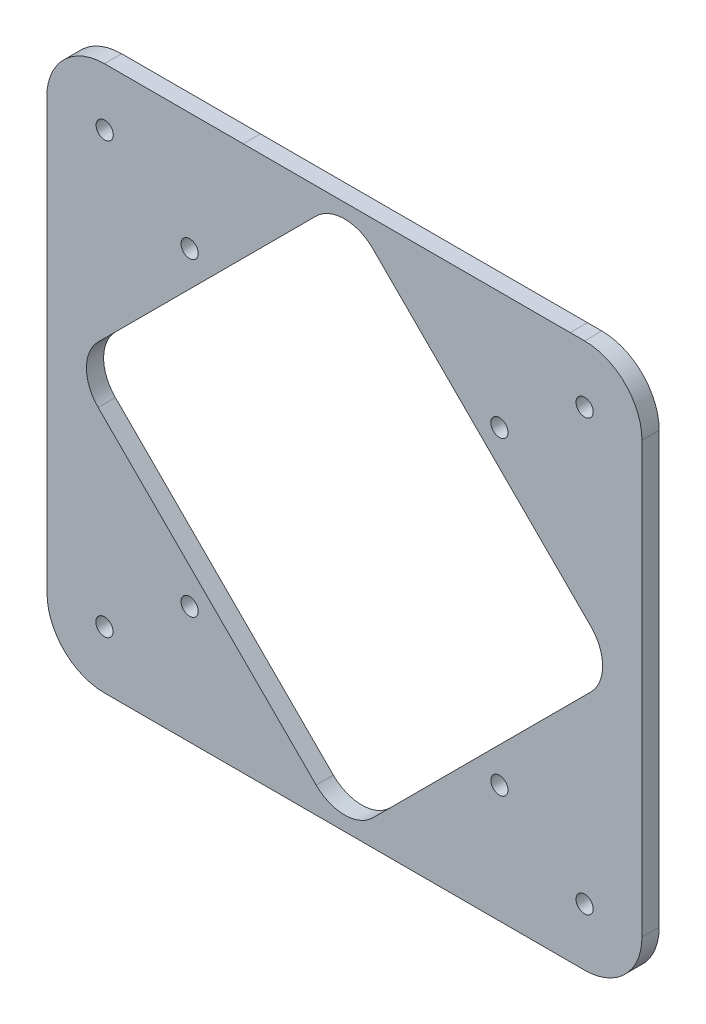
ISO-10303-21;
HEADER;
FILE_DESCRIPTION(('STEP AP214'),'2;1');
FILE_NAME('part.step','',(''),(''),'','','');
FILE_SCHEMA(('AUTOMOTIVE_DESIGN { 1 0 10303 214 1 1 1 1 }'));
ENDSEC;
DATA;
#1=APPLICATION_CONTEXT('core data for automotive mechanical design processes');
#2=APPLICATION_PROTOCOL_DEFINITION('international standard','automotive_design',2000,#1);
#3=PRODUCT_CONTEXT('',#1,'mechanical');
#4=PRODUCT('Part','Part','',(#3));
#5=PRODUCT_RELATED_PRODUCT_CATEGORY('part','',(#4));
#6=PRODUCT_DEFINITION_FORMATION('','',#4);
#7=PRODUCT_DEFINITION_CONTEXT('part definition',#1,'design');
#8=PRODUCT_DEFINITION('design','',#6,#7);
#9=PRODUCT_DEFINITION_SHAPE('','',#8);
#10=(LENGTH_UNIT() NAMED_UNIT(*) SI_UNIT(.MILLI.,.METRE.));
#11=(NAMED_UNIT(*) PLANE_ANGLE_UNIT() SI_UNIT($,.RADIAN.));
#12=(NAMED_UNIT(*) SI_UNIT($,.STERADIAN.) SOLID_ANGLE_UNIT());
#13=UNCERTAINTY_MEASURE_WITH_UNIT(LENGTH_MEASURE(1.E-05),#10,'distance_accuracy_value','');
#14=(GEOMETRIC_REPRESENTATION_CONTEXT(3) GLOBAL_UNCERTAINTY_ASSIGNED_CONTEXT((#13)) GLOBAL_UNIT_ASSIGNED_CONTEXT((#10,
#11,#12)) REPRESENTATION_CONTEXT('',''));
#15=CARTESIAN_POINT('',(0.,0.,0.));
#16=DIRECTION('',(0.,0.,1.));
#17=DIRECTION('',(1.,0.,0.));
#18=AXIS2_PLACEMENT_3D('',#15,#16,#17);
#19=CARTESIAN_POINT('',(2216.74040626952,1503.10014922375,3.));
#20=DIRECTION('',(0.,0.,1.));
#21=DIRECTION('',(1.,0.,0.));
#22=AXIS2_PLACEMENT_3D('',#19,#20,#21);
#23=PLANE('',#22);
#24=CARTESIAN_POINT('',(2216.78279744771,1578.10008841039,3.));
#25=DIRECTION('',(0.,0.,1.));
#26=DIRECTION('',(1.,0.,0.));
#27=AXIS2_PLACEMENT_3D('',#24,#25,#26);
#28=CIRCLE('',#27,1.50000000000011);
#29=CARTESIAN_POINT('',(2218.28279744771,1578.10008841039,3.));
#30=VERTEX_POINT('',#29);
#31=EDGE_CURVE('E246',#30,#30,#28,.T.);
#32=ORIENTED_EDGE('',*,*,#31,.F.);
#33=EDGE_LOOP('',(#32));
#34=FACE_BOUND('',#33,.T.);
#35=CARTESIAN_POINT('',(2300.44026999763,1578.10008841039,3.));
#36=DIRECTION('',(0.,0.,1.));
#37=DIRECTION('',(1.,0.,0.));
#38=AXIS2_PLACEMENT_3D('',#35,#36,#37);
#39=CIRCLE('',#38,1.50000000000011);
#40=CARTESIAN_POINT('',(2301.94026999763,1578.10008841039,3.));
#41=VERTEX_POINT('',#40);
#42=EDGE_CURVE('E258',#41,#41,#39,.T.);
#43=ORIENTED_EDGE('',*,*,#42,.F.);
#44=EDGE_LOOP('',(#43));
#45=FACE_BOUND('',#44,.T.);
#46=CARTESIAN_POINT('',(2231.5903515115,1513.60007121959,3.));
#47=DIRECTION('',(0.,0.,1.));
#48=DIRECTION('',(1.,0.,0.));
#49=AXIS2_PLACEMENT_3D('',#46,#47,#48);
#50=CIRCLE('',#49,1.50000000000011);
#51=CARTESIAN_POINT('',(2233.0903515115,1513.60007121959,3.));
#52=VERTEX_POINT('',#51);
#53=EDGE_CURVE('E270',#52,#52,#50,.T.);
#54=ORIENTED_EDGE('',*,*,#53,.F.);
#55=EDGE_LOOP('',(#54));
#56=FACE_BOUND('',#55,.T.);
#57=CARTESIAN_POINT('',(2216.74034545616,1503.10008841039,3.));
#58=DIRECTION('',(0.,0.,1.));
#59=DIRECTION('',(1.,0.,0.));
#60=AXIS2_PLACEMENT_3D('',#57,#58,#59);
#61=CIRCLE('',#60,1.50000000000011);
#62=CARTESIAN_POINT('',(2218.24034545616,1503.10008841039,3.));
#63=VERTEX_POINT('',#62);
#64=EDGE_CURVE('E282',#63,#63,#61,.T.);
#65=ORIENTED_EDGE('',*,*,#64,.F.);
#66=EDGE_LOOP('',(#65));
#67=FACE_BOUND('',#66,.T.);
#68=CARTESIAN_POINT('',(2216.74040626952,1503.10014922375,3.));
#69=DIRECTION('',(0.,0.,1.));
#70=DIRECTION('',(1.,0.,0.));
#71=AXIS2_PLACEMENT_3D('',#68,#69,#70);
#72=CIRCLE('',#71,10.0000608135399);
#73=CARTESIAN_POINT('',(2206.74034545616,1503.10008841039,3.));
#74=VERTEX_POINT('',#73);
#75=CARTESIAN_POINT('',(2216.74034545616,1493.10008841039,3.));
#76=VERTEX_POINT('',#75);
#77=EDGE_CURVE('E288',#74,#76,#72,.T.);
#78=ORIENTED_EDGE('',*,*,#77,.T.);
#79=DIRECTION('',(1.,0.,0.));
#80=VECTOR('',#79,1.);
#81=CARTESIAN_POINT('',(2300.44034545616,1493.10008841039,3.));
#82=LINE('',#81,#80);
#83=CARTESIAN_POINT('',(2300.44034545616,1493.10008841039,3.));
#84=VERTEX_POINT('',#83);
#85=EDGE_CURVE('E291',#76,#84,#82,.T.);
#86=ORIENTED_EDGE('',*,*,#85,.T.);
#87=CARTESIAN_POINT('',(2300.44026999763,1503.10006386867,3.));
#88=DIRECTION('',(0.,0.,1.));
#89=DIRECTION('',(1.,0.,0.));
#90=AXIS2_PLACEMENT_3D('',#87,#88,#89);
#91=CIRCLE('',#90,9.99997545856066);
#92=CARTESIAN_POINT('',(2310.44024545616,1503.10008841033,3.));
#93=VERTEX_POINT('',#92);
#94=EDGE_CURVE('E294',#84,#93,#91,.T.);
#95=ORIENTED_EDGE('',*,*,#94,.T.);
#96=DIRECTION('',(0.,1.,0.));
#97=VECTOR('',#96,1.);
#98=CARTESIAN_POINT('',(2310.44024545616,1572.46853862692,3.));
#99=LINE('',#98,#97);
#100=CARTESIAN_POINT('',(2310.44024545616,1578.10008841028,3.));
#101=VERTEX_POINT('',#100);
#102=EDGE_CURVE('E296',#93,#101,#99,.T.);
#103=ORIENTED_EDGE('',*,*,#102,.T.);
#104=CARTESIAN_POINT('',(2300.44035535289,1578.10019830652,3.));
#105=DIRECTION('',(0.,0.,1.));
#106=DIRECTION('',(1.,0.,0.));
#107=AXIS2_PLACEMENT_3D('',#104,#105,#106);
#108=CIRCLE('',#107,9.9998901038741);
#109=CARTESIAN_POINT('',(2300.44034545616,1588.10008841039,3.));
#110=VERTEX_POINT('',#109);
#111=EDGE_CURVE('E298',#101,#110,#108,.T.);
#112=ORIENTED_EDGE('',*,*,#111,.T.);
#113=DIRECTION('',(-0.999999995251973,-9.74476991777508E-05,0.));
#114=VECTOR('',#113,1.);
#115=CARTESIAN_POINT('',(2297.94063007068,1588.09984481888,3.));
#116=LINE('',#115,#114);
#117=CARTESIAN_POINT('',(2297.94063007068,1588.09984481888,3.));
#118=VERTEX_POINT('',#117);
#119=EDGE_CURVE('E300',#110,#118,#116,.T.);
#120=ORIENTED_EDGE('',*,*,#119,.T.);
#121=DIRECTION('',(-0.999999999986851,5.12821083089522E-06,0.));
#122=VECTOR('',#121,1.);
#123=CARTESIAN_POINT('',(2297.94063007068,1588.09984481888,3.));
#124=LINE('',#123,#122);
#125=CARTESIAN_POINT('',(2240.94063007143,1588.1001371269,3.));
#126=VERTEX_POINT('',#125);
#127=EDGE_CURVE('E302',#118,#126,#124,.T.);
#128=ORIENTED_EDGE('',*,*,#127,.T.);
#129=DIRECTION('',(-0.999999999997974,-2.01305499982283E-06,0.));
#130=VECTOR('',#129,1.);
#131=CARTESIAN_POINT('',(2216.74034545616,1588.10008841039,3.));
#132=LINE('',#131,#130);
#133=CARTESIAN_POINT('',(2216.74034545616,1588.10008841039,3.));
#134=VERTEX_POINT('',#133);
#135=EDGE_CURVE('E304',#126,#134,#132,.T.);
#136=ORIENTED_EDGE('',*,*,#135,.T.);
#137=CARTESIAN_POINT('',(2216.78285826107,1577.99729640494,3.));
#138=DIRECTION('',(0.,0.,1.));
#139=DIRECTION('',(1.,0.,0.));
#140=AXIS2_PLACEMENT_3D('',#137,#138,#139);
#141=CIRCLE('',#140,10.1028814525364);
#142=CARTESIAN_POINT('',(2206.74034545616,1579.1000884104,3.));
#143=VERTEX_POINT('',#142);
#144=EDGE_CURVE('E306',#134,#143,#141,.T.);
#145=ORIENTED_EDGE('',*,*,#144,.T.);
#146=CARTESIAN_POINT('',(2216.78289739703,1578.09908414489,3.));
#147=DIRECTION('',(0.,0.,1.));
#148=DIRECTION('',(1.,0.,0.));
#149=AXIS2_PLACEMENT_3D('',#146,#147,#148);
#150=CIRCLE('',#149,10.0923168313646);
#151=CARTESIAN_POINT('',(2206.74014545616,1577.10008840977,3.));
#152=VERTEX_POINT('',#151);
#153=EDGE_CURVE('E308',#143,#152,#150,.T.);
#154=ORIENTED_EDGE('',*,*,#153,.T.);
#155=DIRECTION('',(0.,-1.,0.));
#156=VECTOR('',#155,1.);
#157=CARTESIAN_POINT('',(2206.74014545616,1564.74160273374,3.));
#158=LINE('',#157,#156);
#159=CARTESIAN_POINT('',(2206.74014545616,1564.74160273374,3.));
#160=VERTEX_POINT('',#159);
#161=EDGE_CURVE('E310',#152,#160,#158,.T.);
#162=ORIENTED_EDGE('',*,*,#161,.T.);
#163=DIRECTION('',(3.24456661104093E-06,-0.999999999994737,0.));
#164=VECTOR('',#163,1.);
#165=CARTESIAN_POINT('',(2206.74014545616,1564.74160273374,3.));
#166=LINE('',#165,#164);
#167=EDGE_CURVE('E312',#160,#74,#166,.T.);
#168=ORIENTED_EDGE('',*,*,#167,.T.);
#169=EDGE_LOOP('',(#78,#86,#95,#103,#112,#120,#128,#136,#145,#154,#162,#168));
#170=FACE_BOUND('',#169,.T.);
#171=CARTESIAN_POINT('',(2300.44026999763,1503.10006386867,3.));
#172=DIRECTION('',(0.,0.,1.));
#173=DIRECTION('',(1.,0.,0.));
#174=AXIS2_PLACEMENT_3D('',#171,#172,#173);
#175=CIRCLE('',#174,1.50000000000011);
#176=CARTESIAN_POINT('',(2301.94026999763,1503.10006386867,3.));
#177=VERTEX_POINT('',#176);
#178=EDGE_CURVE('E276',#177,#177,#175,.T.);
#179=ORIENTED_EDGE('',*,*,#178,.F.);
#180=EDGE_LOOP('',(#179));
#181=FACE_BOUND('',#180,.T.);
#182=CARTESIAN_POINT('',(2285.59035378313,1513.60007121959,3.));
#183=DIRECTION('',(0.,0.,1.));
#184=DIRECTION('',(1.,0.,0.));
#185=AXIS2_PLACEMENT_3D('',#182,#183,#184);
#186=CIRCLE('',#185,1.50000000000011);
#187=CARTESIAN_POINT('',(2287.09035378313,1513.60007121959,3.));
#188=VERTEX_POINT('',#187);
#189=EDGE_CURVE('E264',#188,#188,#186,.T.);
#190=ORIENTED_EDGE('',*,*,#189,.F.);
#191=EDGE_LOOP('',(#190));
#192=FACE_BOUND('',#191,.T.);
#193=CARTESIAN_POINT('',(2285.59035378313,1567.60011895622,3.));
#194=DIRECTION('',(0.,0.,1.));
#195=DIRECTION('',(1.,0.,0.));
#196=AXIS2_PLACEMENT_3D('',#193,#194,#195);
#197=CIRCLE('',#196,1.50000000000011);
#198=CARTESIAN_POINT('',(2287.09035378313,1567.60011895622,3.));
#199=VERTEX_POINT('',#198);
#200=EDGE_CURVE('E252',#199,#199,#197,.T.);
#201=ORIENTED_EDGE('',*,*,#200,.F.);
#202=EDGE_LOOP('',(#201));
#203=FACE_BOUND('',#202,.T.);
#204=CARTESIAN_POINT('',(2231.5903515115,1567.60011895622,3.));
#205=DIRECTION('',(0.,0.,1.));
#206=DIRECTION('',(1.,0.,0.));
#207=AXIS2_PLACEMENT_3D('',#204,#205,#206);
#208=CIRCLE('',#207,1.50000000000011);
#209=CARTESIAN_POINT('',(2233.0903515115,1567.60011895622,3.));
#210=VERTEX_POINT('',#209);
#211=EDGE_CURVE('E240',#210,#210,#208,.T.);
#212=ORIENTED_EDGE('',*,*,#211,.F.);
#213=EDGE_LOOP('',(#212));
#214=FACE_BOUND('',#213,.T.);
#215=DIRECTION('',(-0.707106781186554,0.707106781186541,0.));
#216=VECTOR('',#215,1.);
#217=CARTESIAN_POINT('',(2263.54009292447,1583.54117663951,3.));
#218=LINE('',#217,#216);
#219=CARTESIAN_POINT('',(2301.53147095311,1545.54979861087,3.));
#220=VERTEX_POINT('',#219);
#221=CARTESIAN_POINT('',(2263.54009292447,1583.54117663951,3.));
#222=VERTEX_POINT('',#221);
#223=EDGE_CURVE('E183',#220,#222,#218,.T.);
#224=ORIENTED_EDGE('',*,*,#223,.F.);
#225=CARTESIAN_POINT('',(2296.58172348481,1540.60005114256,3.));
#226=DIRECTION('',(0.,0.,1.));
#227=DIRECTION('',(1.,0.,0.));
#228=AXIS2_PLACEMENT_3D('',#225,#226,#227);
#229=CIRCLE('',#228,7.00000000000002);
#230=CARTESIAN_POINT('',(2301.53147095311,1535.65030367425,3.));
#231=VERTEX_POINT('',#230);
#232=EDGE_CURVE('E175',#231,#220,#229,.T.);
#233=ORIENTED_EDGE('',*,*,#232,.F.);
#234=DIRECTION('',(0.707106781186543,0.707106781186552,0.));
#235=VECTOR('',#234,1.);
#236=CARTESIAN_POINT('',(2301.53147095311,1535.65030367425,3.));
#237=LINE('',#236,#235);
#238=CARTESIAN_POINT('',(2263.54009292447,1497.65892564561,3.));
#239=VERTEX_POINT('',#238);
#240=EDGE_CURVE('E208',#239,#231,#237,.T.);
#241=ORIENTED_EDGE('',*,*,#240,.F.);
#242=CARTESIAN_POINT('',(2258.59034545616,1502.60867311391,3.));
#243=DIRECTION('',(0.,0.,1.));
#244=DIRECTION('',(1.,0.,0.));
#245=AXIS2_PLACEMENT_3D('',#242,#243,#244);
#246=CIRCLE('',#245,6.99999999999962);
#247=CARTESIAN_POINT('',(2253.64059798786,1497.65892564561,3.));
#248=VERTEX_POINT('',#247);
#249=EDGE_CURVE('E206',#248,#239,#246,.T.);
#250=ORIENTED_EDGE('',*,*,#249,.F.);
#251=DIRECTION('',(0.707106781186543,-0.707106781186552,0.));
#252=VECTOR('',#251,1.);
#253=CARTESIAN_POINT('',(2215.64921995921,1535.65030367425,3.));
#254=LINE('',#253,#252);
#255=CARTESIAN_POINT('',(2215.64921995921,1535.65030367425,3.));
#256=VERTEX_POINT('',#255);
#257=EDGE_CURVE('E204',#256,#248,#254,.T.);
#258=ORIENTED_EDGE('',*,*,#257,.F.);
#259=CARTESIAN_POINT('',(2220.59896742751,1540.60005114256,3.));
#260=DIRECTION('',(0.,0.,1.));
#261=DIRECTION('',(1.,0.,0.));
#262=AXIS2_PLACEMENT_3D('',#259,#260,#261);
#263=CIRCLE('',#262,7.00000000000002);
#264=CARTESIAN_POINT('',(2215.64921995921,1545.54979861087,3.));
#265=VERTEX_POINT('',#264);
#266=EDGE_CURVE('E202',#265,#256,#263,.T.);
#267=ORIENTED_EDGE('',*,*,#266,.F.);
#268=DIRECTION('',(-0.70710678118655,-0.707106781186545,0.));
#269=VECTOR('',#268,1.);
#270=CARTESIAN_POINT('',(2215.64921995921,1545.54979861087,3.));
#271=LINE('',#270,#269);
#272=CARTESIAN_POINT('',(2253.64059798786,1583.54117663952,3.));
#273=VERTEX_POINT('',#272);
#274=EDGE_CURVE('E198',#273,#265,#271,.T.);
#275=ORIENTED_EDGE('',*,*,#274,.F.);
#276=CARTESIAN_POINT('',(2258.59034545616,1578.59142917121,3.));
#277=DIRECTION('',(0.,0.,1.));
#278=DIRECTION('',(1.,0.,0.));
#279=AXIS2_PLACEMENT_3D('',#276,#277,#278);
#280=CIRCLE('',#279,6.99999999999962);
#281=EDGE_CURVE('E196',#222,#273,#280,.T.);
#282=ORIENTED_EDGE('',*,*,#281,.F.);
#283=EDGE_LOOP('',(#224,#233,#241,#250,#258,#267,#275,#282));
#284=FACE_BOUND('',#283,.T.);
#285=ADVANCED_FACE('F38',(#34,#45,#56,#67,#170,#181,#192,#203,#214,#284),#23,.T.);
#286=CARTESIAN_POINT('',(2216.74040626952,1503.10014922375,0.));
#287=DIRECTION('',(0.,0.,1.));
#288=DIRECTION('',(1.,0.,0.));
#289=AXIS2_PLACEMENT_3D('',#286,#287,#288);
#290=PLANE('',#289);
#291=CARTESIAN_POINT('',(2231.5903515115,1567.60011895622,0.));
#292=DIRECTION('',(0.,0.,1.));
#293=DIRECTION('',(1.,0.,0.));
#294=AXIS2_PLACEMENT_3D('',#291,#292,#293);
#295=CIRCLE('',#294,1.50000000000011);
#296=CARTESIAN_POINT('',(2233.0903515115,1567.60011895622,0.));
#297=VERTEX_POINT('',#296);
#298=EDGE_CURVE('E191',#297,#297,#295,.T.);
#299=ORIENTED_EDGE('',*,*,#298,.T.);
#300=EDGE_LOOP('',(#299));
#301=FACE_BOUND('',#300,.T.);
#302=CARTESIAN_POINT('',(2216.78279744771,1578.10008841039,0.));
#303=DIRECTION('',(0.,0.,1.));
#304=DIRECTION('',(1.,0.,0.));
#305=AXIS2_PLACEMENT_3D('',#302,#303,#304);
#306=CIRCLE('',#305,1.50000000000011);
#307=CARTESIAN_POINT('',(2218.28279744771,1578.10008841039,0.));
#308=VERTEX_POINT('',#307);
#309=EDGE_CURVE('E243',#308,#308,#306,.T.);
#310=ORIENTED_EDGE('',*,*,#309,.T.);
#311=EDGE_LOOP('',(#310));
#312=FACE_BOUND('',#311,.T.);
#313=CARTESIAN_POINT('',(2285.59035378313,1567.60011895622,0.));
#314=DIRECTION('',(0.,0.,1.));
#315=DIRECTION('',(1.,0.,0.));
#316=AXIS2_PLACEMENT_3D('',#313,#314,#315);
#317=CIRCLE('',#316,1.50000000000011);
#318=CARTESIAN_POINT('',(2287.09035378313,1567.60011895622,0.));
#319=VERTEX_POINT('',#318);
#320=EDGE_CURVE('E249',#319,#319,#317,.T.);
#321=ORIENTED_EDGE('',*,*,#320,.T.);
#322=EDGE_LOOP('',(#321));
#323=FACE_BOUND('',#322,.T.);
#324=CARTESIAN_POINT('',(2300.44026999763,1578.10008841039,0.));
#325=DIRECTION('',(0.,0.,1.));
#326=DIRECTION('',(1.,0.,0.));
#327=AXIS2_PLACEMENT_3D('',#324,#325,#326);
#328=CIRCLE('',#327,1.50000000000011);
#329=CARTESIAN_POINT('',(2301.94026999763,1578.10008841039,0.));
#330=VERTEX_POINT('',#329);
#331=EDGE_CURVE('E255',#330,#330,#328,.T.);
#332=ORIENTED_EDGE('',*,*,#331,.T.);
#333=EDGE_LOOP('',(#332));
#334=FACE_BOUND('',#333,.T.);
#335=CARTESIAN_POINT('',(2285.59035378313,1513.60007121959,0.));
#336=DIRECTION('',(0.,0.,1.));
#337=DIRECTION('',(1.,0.,0.));
#338=AXIS2_PLACEMENT_3D('',#335,#336,#337);
#339=CIRCLE('',#338,1.50000000000011);
#340=CARTESIAN_POINT('',(2287.09035378313,1513.60007121959,0.));
#341=VERTEX_POINT('',#340);
#342=EDGE_CURVE('E261',#341,#341,#339,.T.);
#343=ORIENTED_EDGE('',*,*,#342,.T.);
#344=EDGE_LOOP('',(#343));
#345=FACE_BOUND('',#344,.T.);
#346=CARTESIAN_POINT('',(2231.5903515115,1513.60007121959,0.));
#347=DIRECTION('',(0.,0.,1.));
#348=DIRECTION('',(1.,0.,0.));
#349=AXIS2_PLACEMENT_3D('',#346,#347,#348);
#350=CIRCLE('',#349,1.50000000000011);
#351=CARTESIAN_POINT('',(2233.0903515115,1513.60007121959,0.));
#352=VERTEX_POINT('',#351);
#353=EDGE_CURVE('E267',#352,#352,#350,.T.);
#354=ORIENTED_EDGE('',*,*,#353,.T.);
#355=EDGE_LOOP('',(#354));
#356=FACE_BOUND('',#355,.T.);
#357=CARTESIAN_POINT('',(2300.44026999763,1503.10006386867,0.));
#358=DIRECTION('',(0.,0.,1.));
#359=DIRECTION('',(1.,0.,0.));
#360=AXIS2_PLACEMENT_3D('',#357,#358,#359);
#361=CIRCLE('',#360,1.50000000000011);
#362=CARTESIAN_POINT('',(2301.94026999763,1503.10006386867,0.));
#363=VERTEX_POINT('',#362);
#364=EDGE_CURVE('E273',#363,#363,#361,.T.);
#365=ORIENTED_EDGE('',*,*,#364,.T.);
#366=EDGE_LOOP('',(#365));
#367=FACE_BOUND('',#366,.T.);
#368=CARTESIAN_POINT('',(2216.74034545616,1503.10008841039,0.));
#369=DIRECTION('',(0.,0.,1.));
#370=DIRECTION('',(1.,0.,0.));
#371=AXIS2_PLACEMENT_3D('',#368,#369,#370);
#372=CIRCLE('',#371,1.50000000000011);
#373=CARTESIAN_POINT('',(2218.24034545616,1503.10008841039,0.));
#374=VERTEX_POINT('',#373);
#375=EDGE_CURVE('E279',#374,#374,#372,.T.);
#376=ORIENTED_EDGE('',*,*,#375,.T.);
#377=EDGE_LOOP('',(#376));
#378=FACE_BOUND('',#377,.T.);
#379=CARTESIAN_POINT('',(2216.74040626952,1503.10014922375,0.));
#380=DIRECTION('',(0.,0.,1.));
#381=DIRECTION('',(1.,0.,0.));
#382=AXIS2_PLACEMENT_3D('',#379,#380,#381);
#383=CIRCLE('',#382,10.0000608135399);
#384=CARTESIAN_POINT('',(2206.74034545616,1503.10008841039,0.));
#385=VERTEX_POINT('',#384);
#386=CARTESIAN_POINT('',(2216.74034545616,1493.10008841039,0.));
#387=VERTEX_POINT('',#386);
#388=EDGE_CURVE('E285',#385,#387,#383,.T.);
#389=ORIENTED_EDGE('',*,*,#388,.F.);
#390=DIRECTION('',(3.24456661104093E-06,-0.999999999994737,0.));
#391=VECTOR('',#390,1.);
#392=CARTESIAN_POINT('',(2206.74014545616,1564.74160273374,0.));
#393=LINE('',#392,#391);
#394=CARTESIAN_POINT('',(2206.74014545616,1564.74160273374,0.));
#395=VERTEX_POINT('',#394);
#396=EDGE_CURVE('E292',#395,#385,#393,.T.);
#397=ORIENTED_EDGE('',*,*,#396,.F.);
#398=DIRECTION('',(0.,-1.,0.));
#399=VECTOR('',#398,1.);
#400=CARTESIAN_POINT('',(2206.74014545616,1564.74160273374,0.));
#401=LINE('',#400,#399);
#402=CARTESIAN_POINT('',(2206.74014545616,1577.10008840977,0.));
#403=VERTEX_POINT('',#402);
#404=EDGE_CURVE('E337',#403,#395,#401,.T.);
#405=ORIENTED_EDGE('',*,*,#404,.F.);
#406=CARTESIAN_POINT('',(2216.78289739703,1578.09908414489,0.));
#407=DIRECTION('',(0.,0.,1.));
#408=DIRECTION('',(1.,0.,0.));
#409=AXIS2_PLACEMENT_3D('',#406,#407,#408);
#410=CIRCLE('',#409,10.0923168313646);
#411=CARTESIAN_POINT('',(2206.74034545616,1579.1000884104,0.));
#412=VERTEX_POINT('',#411);
#413=EDGE_CURVE('E335',#412,#403,#410,.T.);
#414=ORIENTED_EDGE('',*,*,#413,.F.);
#415=CARTESIAN_POINT('',(2216.78285826107,1577.99729640494,0.));
#416=DIRECTION('',(0.,0.,1.));
#417=DIRECTION('',(1.,0.,0.));
#418=AXIS2_PLACEMENT_3D('',#415,#416,#417);
#419=CIRCLE('',#418,10.1028814525364);
#420=CARTESIAN_POINT('',(2216.74034545616,1588.10008841039,0.));
#421=VERTEX_POINT('',#420);
#422=EDGE_CURVE('E333',#421,#412,#419,.T.);
#423=ORIENTED_EDGE('',*,*,#422,.F.);
#424=DIRECTION('',(-0.999999999997974,-2.01305499982283E-06,0.));
#425=VECTOR('',#424,1.);
#426=CARTESIAN_POINT('',(2216.74034545616,1588.10008841039,0.));
#427=LINE('',#426,#425);
#428=CARTESIAN_POINT('',(2240.94063007143,1588.1001371269,0.));
#429=VERTEX_POINT('',#428);
#430=EDGE_CURVE('E331',#429,#421,#427,.T.);
#431=ORIENTED_EDGE('',*,*,#430,.F.);
#432=DIRECTION('',(-0.999999999986851,5.12821083376025E-06,0.));
#433=VECTOR('',#432,1.);
#434=CARTESIAN_POINT('',(2265.9406300711,1588.10000892163,0.));
#435=LINE('',#434,#433);
#436=CARTESIAN_POINT('',(2297.94063007068,1588.09984481888,0.));
#437=VERTEX_POINT('',#436);
#438=EDGE_CURVE('E329',#437,#429,#435,.T.);
#439=ORIENTED_EDGE('',*,*,#438,.F.);
#440=DIRECTION('',(-0.999999995251973,-9.74476991777508E-05,0.));
#441=VECTOR('',#440,1.);
#442=CARTESIAN_POINT('',(2297.94063007068,1588.09984481888,0.));
#443=LINE('',#442,#441);
#444=CARTESIAN_POINT('',(2300.44034545616,1588.10008841039,0.));
#445=VERTEX_POINT('',#444);
#446=EDGE_CURVE('E326',#445,#437,#443,.T.);
#447=ORIENTED_EDGE('',*,*,#446,.F.);
#448=CARTESIAN_POINT('',(2300.44035535289,1578.10019830652,0.));
#449=DIRECTION('',(0.,0.,1.));
#450=DIRECTION('',(1.,0.,0.));
#451=AXIS2_PLACEMENT_3D('',#448,#449,#450);
#452=CIRCLE('',#451,9.9998901038741);
#453=CARTESIAN_POINT('',(2310.44024545616,1578.10008841028,0.));
#454=VERTEX_POINT('',#453);
#455=EDGE_CURVE('E324',#454,#445,#452,.T.);
#456=ORIENTED_EDGE('',*,*,#455,.F.);
#457=DIRECTION('',(0.,1.,0.));
#458=VECTOR('',#457,1.);
#459=CARTESIAN_POINT('',(2310.44024545616,1572.46853862692,0.));
#460=LINE('',#459,#458);
#461=CARTESIAN_POINT('',(2310.44024545616,1503.10008841033,0.));
#462=VERTEX_POINT('',#461);
#463=EDGE_CURVE('E322',#462,#454,#460,.T.);
#464=ORIENTED_EDGE('',*,*,#463,.F.);
#465=CARTESIAN_POINT('',(2300.44026999763,1503.10006386867,0.));
#466=DIRECTION('',(0.,0.,1.));
#467=DIRECTION('',(1.,0.,0.));
#468=AXIS2_PLACEMENT_3D('',#465,#466,#467);
#469=CIRCLE('',#468,9.99997545856066);
#470=CARTESIAN_POINT('',(2300.44034545616,1493.10008841039,0.));
#471=VERTEX_POINT('',#470);
#472=EDGE_CURVE('E319',#471,#462,#469,.T.);
#473=ORIENTED_EDGE('',*,*,#472,.F.);
#474=DIRECTION('',(1.,0.,0.));
#475=VECTOR('',#474,1.);
#476=CARTESIAN_POINT('',(2300.44034545616,1493.10008841039,0.));
#477=LINE('',#476,#475);
#478=EDGE_CURVE('E317',#387,#471,#477,.T.);
#479=ORIENTED_EDGE('',*,*,#478,.F.);
#480=EDGE_LOOP('',(#389,#397,#405,#414,#423,#431,#439,#447,#456,#464,#473,#479));
#481=FACE_BOUND('',#480,.T.);
#482=CARTESIAN_POINT('',(2296.58172348481,1540.60005114256,0.));
#483=DIRECTION('',(0.,0.,1.));
#484=DIRECTION('',(1.,0.,0.));
#485=AXIS2_PLACEMENT_3D('',#482,#483,#484);
#486=CIRCLE('',#485,7.00000000000002);
#487=CARTESIAN_POINT('',(2301.53147095311,1535.65030367425,0.));
#488=VERTEX_POINT('',#487);
#489=CARTESIAN_POINT('',(2301.53147095311,1545.54979861087,0.));
#490=VERTEX_POINT('',#489);
#491=EDGE_CURVE('E61',#488,#490,#486,.T.);
#492=ORIENTED_EDGE('',*,*,#491,.T.);
#493=DIRECTION('',(-0.707106781186554,0.707106781186541,0.));
#494=VECTOR('',#493,1.);
#495=CARTESIAN_POINT('',(2263.54009292447,1583.54117663951,0.));
#496=LINE('',#495,#494);
#497=CARTESIAN_POINT('',(2263.54009292447,1583.54117663951,0.));
#498=VERTEX_POINT('',#497);
#499=EDGE_CURVE('E190',#490,#498,#496,.T.);
#500=ORIENTED_EDGE('',*,*,#499,.T.);
#501=CARTESIAN_POINT('',(2258.59034545616,1578.59142917121,0.));
#502=DIRECTION('',(0.,0.,1.));
#503=DIRECTION('',(1.,0.,0.));
#504=AXIS2_PLACEMENT_3D('',#501,#502,#503);
#505=CIRCLE('',#504,6.99999999999962);
#506=CARTESIAN_POINT('',(2253.64059798786,1583.54117663952,0.));
#507=VERTEX_POINT('',#506);
#508=EDGE_CURVE('E212',#498,#507,#505,.T.);
#509=ORIENTED_EDGE('',*,*,#508,.T.);
#510=DIRECTION('',(-0.70710678118655,-0.707106781186545,0.));
#511=VECTOR('',#510,1.);
#512=CARTESIAN_POINT('',(2215.64921995921,1545.54979861087,0.));
#513=LINE('',#512,#511);
#514=CARTESIAN_POINT('',(2215.64921995921,1545.54979861087,0.));
#515=VERTEX_POINT('',#514);
#516=EDGE_CURVE('E215',#507,#515,#513,.T.);
#517=ORIENTED_EDGE('',*,*,#516,.T.);
#518=CARTESIAN_POINT('',(2220.59896742751,1540.60005114256,0.));
#519=DIRECTION('',(0.,0.,1.));
#520=DIRECTION('',(1.,0.,0.));
#521=AXIS2_PLACEMENT_3D('',#518,#519,#520);
#522=CIRCLE('',#521,7.00000000000002);
#523=CARTESIAN_POINT('',(2215.64921995921,1535.65030367425,0.));
#524=VERTEX_POINT('',#523);
#525=EDGE_CURVE('E218',#515,#524,#522,.T.);
#526=ORIENTED_EDGE('',*,*,#525,.T.);
#527=DIRECTION('',(0.707106781186543,-0.707106781186552,0.));
#528=VECTOR('',#527,1.);
#529=CARTESIAN_POINT('',(2215.64921995921,1535.65030367425,0.));
#530=LINE('',#529,#528);
#531=CARTESIAN_POINT('',(2253.64059798786,1497.65892564561,0.));
#532=VERTEX_POINT('',#531);
#533=EDGE_CURVE('E221',#524,#532,#530,.T.);
#534=ORIENTED_EDGE('',*,*,#533,.T.);
#535=CARTESIAN_POINT('',(2258.59034545616,1502.60867311391,0.));
#536=DIRECTION('',(0.,0.,1.));
#537=DIRECTION('',(1.,0.,0.));
#538=AXIS2_PLACEMENT_3D('',#535,#536,#537);
#539=CIRCLE('',#538,6.99999999999962);
#540=CARTESIAN_POINT('',(2263.54009292447,1497.65892564561,0.));
#541=VERTEX_POINT('',#540);
#542=EDGE_CURVE('E224',#532,#541,#539,.T.);
#543=ORIENTED_EDGE('',*,*,#542,.T.);
#544=DIRECTION('',(0.707106781186543,0.707106781186552,0.));
#545=VECTOR('',#544,1.);
#546=CARTESIAN_POINT('',(2301.53147095311,1535.65030367425,0.));
#547=LINE('',#546,#545);
#548=EDGE_CURVE('E184',#541,#488,#547,.T.);
#549=ORIENTED_EDGE('',*,*,#548,.T.);
#550=EDGE_LOOP('',(#492,#500,#509,#517,#526,#534,#543,#549));
#551=FACE_BOUND('',#550,.T.);
#552=ADVANCED_FACE('F378',(#301,#312,#323,#334,#345,#356,#367,#378,#481,#551),#290,.F.);
#553=CARTESIAN_POINT('',(2216.74040626952,1503.10014922375,3.));
#554=DIRECTION('',(0.,0.,-1.));
#555=DIRECTION('',(-1.,0.,0.));
#556=AXIS2_PLACEMENT_3D('',#553,#554,#555);
#557=CYLINDRICAL_SURFACE('',#556,10.0000608135399);
#558=ORIENTED_EDGE('',*,*,#388,.T.);
#559=DIRECTION('',(0.,0.,-1.));
#560=VECTOR('',#559,1.);
#561=CARTESIAN_POINT('',(2216.74034545616,1493.10008841039,3.));
#562=LINE('',#561,#560);
#563=EDGE_CURVE('E11',#76,#387,#562,.T.);
#564=ORIENTED_EDGE('',*,*,#563,.F.);
#565=ORIENTED_EDGE('',*,*,#77,.F.);
#566=DIRECTION('',(0.,0.,-1.));
#567=VECTOR('',#566,1.);
#568=CARTESIAN_POINT('',(2206.74034545616,1503.10008841039,3.));
#569=LINE('',#568,#567);
#570=EDGE_CURVE('E314',#74,#385,#569,.T.);
#571=ORIENTED_EDGE('',*,*,#570,.T.);
#572=EDGE_LOOP('',(#558,#564,#565,#571));
#573=FACE_BOUND('',#572,.T.);
#574=ADVANCED_FACE('F40',(#573),#557,.T.);
#575=CARTESIAN_POINT('',(2300.44034545616,1493.10008841039,3.));
#576=DIRECTION('',(0.,1.,0.));
#577=DIRECTION('',(-1.,0.,0.));
#578=AXIS2_PLACEMENT_3D('',#575,#576,#577);
#579=PLANE('',#578);
#580=ORIENTED_EDGE('',*,*,#478,.T.);
#581=DIRECTION('',(0.,0.,-1.));
#582=VECTOR('',#581,1.);
#583=CARTESIAN_POINT('',(2300.44034545616,1493.10008841039,3.));
#584=LINE('',#583,#582);
#585=EDGE_CURVE('E46',#84,#471,#584,.T.);
#586=ORIENTED_EDGE('',*,*,#585,.F.);
#587=ORIENTED_EDGE('',*,*,#85,.F.);
#588=ORIENTED_EDGE('',*,*,#563,.T.);
#589=EDGE_LOOP('',(#580,#586,#587,#588));
#590=FACE_BOUND('',#589,.T.);
#591=ADVANCED_FACE('F396',(#590),#579,.F.);
#592=CARTESIAN_POINT('',(2300.44026999763,1503.10006386867,3.));
#593=DIRECTION('',(0.,0.,-1.));
#594=DIRECTION('',(-1.,0.,0.));
#595=AXIS2_PLACEMENT_3D('',#592,#593,#594);
#596=CYLINDRICAL_SURFACE('',#595,9.99997545856066);
#597=ORIENTED_EDGE('',*,*,#472,.T.);
#598=DIRECTION('',(0.,0.,-1.));
#599=VECTOR('',#598,1.);
#600=CARTESIAN_POINT('',(2310.44024545616,1503.10008841033,3.));
#601=LINE('',#600,#599);
#602=EDGE_CURVE('E366',#93,#462,#601,.T.);
#603=ORIENTED_EDGE('',*,*,#602,.F.);
#604=ORIENTED_EDGE('',*,*,#94,.F.);
#605=ORIENTED_EDGE('',*,*,#585,.T.);
#606=EDGE_LOOP('',(#597,#603,#604,#605));
#607=FACE_BOUND('',#606,.T.);
#608=ADVANCED_FACE('F373',(#607),#596,.T.);
#609=CARTESIAN_POINT('',(2310.44024545616,1572.46853862692,3.));
#610=DIRECTION('',(-1.,0.,0.));
#611=DIRECTION('',(0.,0.,1.));
#612=AXIS2_PLACEMENT_3D('',#609,#610,#611);
#613=PLANE('',#612);
#614=ORIENTED_EDGE('',*,*,#463,.T.);
#615=DIRECTION('',(0.,0.,-1.));
#616=VECTOR('',#615,1.);
#617=CARTESIAN_POINT('',(2310.44024545616,1578.10008841028,3.));
#618=LINE('',#617,#616);
#619=EDGE_CURVE('E363',#101,#454,#618,.T.);
#620=ORIENTED_EDGE('',*,*,#619,.F.);
#621=ORIENTED_EDGE('',*,*,#102,.F.);
#622=ORIENTED_EDGE('',*,*,#602,.T.);
#623=EDGE_LOOP('',(#614,#620,#621,#622));
#624=FACE_BOUND('',#623,.T.);
#625=ADVANCED_FACE('F384',(#624),#613,.F.);
#626=CARTESIAN_POINT('',(2300.44035535289,1578.10019830652,3.));
#627=DIRECTION('',(0.,0.,-1.));
#628=DIRECTION('',(-1.,0.,0.));
#629=AXIS2_PLACEMENT_3D('',#626,#627,#628);
#630=CYLINDRICAL_SURFACE('',#629,9.9998901038741);
#631=ORIENTED_EDGE('',*,*,#455,.T.);
#632=DIRECTION('',(0.,0.,-1.));
#633=VECTOR('',#632,1.);
#634=CARTESIAN_POINT('',(2300.44034545616,1588.10008841039,3.));
#635=LINE('',#634,#633);
#636=EDGE_CURVE('E360',#110,#445,#635,.T.);
#637=ORIENTED_EDGE('',*,*,#636,.F.);
#638=ORIENTED_EDGE('',*,*,#111,.F.);
#639=ORIENTED_EDGE('',*,*,#619,.T.);
#640=EDGE_LOOP('',(#631,#637,#638,#639));
#641=FACE_BOUND('',#640,.T.);
#642=ADVANCED_FACE('F388',(#641),#630,.T.);
#643=CARTESIAN_POINT('',(2297.94063007068,1588.09984481888,3.));
#644=DIRECTION('',(9.74476991777507E-05,-0.999999995251973,0.));
#645=DIRECTION('',(0.999999995251973,9.74476991777508E-05,0.));
#646=AXIS2_PLACEMENT_3D('',#643,#644,#645);
#647=PLANE('',#646);
#648=ORIENTED_EDGE('',*,*,#446,.T.);
#649=DIRECTION('',(0.,0.,-1.));
#650=VECTOR('',#649,1.);
#651=CARTESIAN_POINT('',(2297.94063007068,1588.09984481888,3.));
#652=LINE('',#651,#650);
#653=EDGE_CURVE('E357',#118,#437,#652,.T.);
#654=ORIENTED_EDGE('',*,*,#653,.F.);
#655=ORIENTED_EDGE('',*,*,#119,.F.);
#656=ORIENTED_EDGE('',*,*,#636,.T.);
#657=EDGE_LOOP('',(#648,#654,#655,#656));
#658=FACE_BOUND('',#657,.T.);
#659=ADVANCED_FACE('F428',(#658),#647,.F.);
#660=CARTESIAN_POINT('',(2265.9406300711,1588.10000892163,3.));
#661=DIRECTION('',(-5.12821083376025E-06,-0.999999999986851,0.));
#662=DIRECTION('',(0.999999999986851,-5.12821083376025E-06,0.));
#663=AXIS2_PLACEMENT_3D('',#660,#661,#662);
#664=PLANE('',#663);
#665=ORIENTED_EDGE('',*,*,#438,.T.);
#666=DIRECTION('',(0.,0.,-1.));
#667=VECTOR('',#666,1.);
#668=CARTESIAN_POINT('',(2240.94063007143,1588.1001371269,3.));
#669=LINE('',#668,#667);
#670=EDGE_CURVE('E354',#126,#429,#669,.T.);
#671=ORIENTED_EDGE('',*,*,#670,.F.);
#672=ORIENTED_EDGE('',*,*,#127,.F.);
#673=ORIENTED_EDGE('',*,*,#653,.T.);
#674=EDGE_LOOP('',(#665,#671,#672,#673));
#675=FACE_BOUND('',#674,.T.);
#676=ADVANCED_FACE('F426',(#675),#664,.F.);
#677=CARTESIAN_POINT('',(2216.74034545616,1588.10008841039,3.));
#678=DIRECTION('',(2.01305499982283E-06,-0.999999999997974,0.));
#679=DIRECTION('',(0.999999999997974,2.01305499982283E-06,0.));
#680=AXIS2_PLACEMENT_3D('',#677,#678,#679);
#681=PLANE('',#680);
#682=ORIENTED_EDGE('',*,*,#430,.T.);
#683=DIRECTION('',(0.,0.,-1.));
#684=VECTOR('',#683,1.);
#685=CARTESIAN_POINT('',(2216.74034545616,1588.10008841039,3.));
#686=LINE('',#685,#684);
#687=EDGE_CURVE('E351',#134,#421,#686,.T.);
#688=ORIENTED_EDGE('',*,*,#687,.F.);
#689=ORIENTED_EDGE('',*,*,#135,.F.);
#690=ORIENTED_EDGE('',*,*,#670,.T.);
#691=EDGE_LOOP('',(#682,#688,#689,#690));
#692=FACE_BOUND('',#691,.T.);
#693=ADVANCED_FACE('F422',(#692),#681,.F.);
#694=CARTESIAN_POINT('',(2216.78285826107,1577.99729640494,3.));
#695=DIRECTION('',(0.,0.,-1.));
#696=DIRECTION('',(-1.,0.,0.));
#697=AXIS2_PLACEMENT_3D('',#694,#695,#696);
#698=CYLINDRICAL_SURFACE('',#697,10.1028814525364);
#699=ORIENTED_EDGE('',*,*,#422,.T.);
#700=DIRECTION('',(0.,0.,-1.));
#701=VECTOR('',#700,1.);
#702=CARTESIAN_POINT('',(2206.74034545616,1579.1000884104,3.));
#703=LINE('',#702,#701);
#704=EDGE_CURVE('E348',#143,#412,#703,.T.);
#705=ORIENTED_EDGE('',*,*,#704,.F.);
#706=ORIENTED_EDGE('',*,*,#144,.F.);
#707=ORIENTED_EDGE('',*,*,#687,.T.);
#708=EDGE_LOOP('',(#699,#705,#706,#707));
#709=FACE_BOUND('',#708,.T.);
#710=ADVANCED_FACE('F417',(#709),#698,.T.);
#711=CARTESIAN_POINT('',(2216.78289739703,1578.09908414489,3.));
#712=DIRECTION('',(0.,0.,-1.));
#713=DIRECTION('',(-1.,0.,0.));
#714=AXIS2_PLACEMENT_3D('',#711,#712,#713);
#715=CYLINDRICAL_SURFACE('',#714,10.0923168313646);
#716=ORIENTED_EDGE('',*,*,#413,.T.);
#717=DIRECTION('',(0.,0.,-1.));
#718=VECTOR('',#717,1.);
#719=CARTESIAN_POINT('',(2206.74014545616,1577.10008840977,3.));
#720=LINE('',#719,#718);
#721=EDGE_CURVE('E345',#152,#403,#720,.T.);
#722=ORIENTED_EDGE('',*,*,#721,.F.);
#723=ORIENTED_EDGE('',*,*,#153,.F.);
#724=ORIENTED_EDGE('',*,*,#704,.T.);
#725=EDGE_LOOP('',(#716,#722,#723,#724));
#726=FACE_BOUND('',#725,.T.);
#727=ADVANCED_FACE('F412',(#726),#715,.T.);
#728=CARTESIAN_POINT('',(2206.74014545616,1564.74160273374,3.));
#729=DIRECTION('',(1.,0.,0.));
#730=DIRECTION('',(0.,0.,-1.));
#731=AXIS2_PLACEMENT_3D('',#728,#729,#730);
#732=PLANE('',#731);
#733=ORIENTED_EDGE('',*,*,#404,.T.);
#734=DIRECTION('',(0.,0.,-1.));
#735=VECTOR('',#734,1.);
#736=CARTESIAN_POINT('',(2206.74014545616,1564.74160273374,3.));
#737=LINE('',#736,#735);
#738=EDGE_CURVE('E342',#160,#395,#737,.T.);
#739=ORIENTED_EDGE('',*,*,#738,.F.);
#740=ORIENTED_EDGE('',*,*,#161,.F.);
#741=ORIENTED_EDGE('',*,*,#721,.T.);
#742=EDGE_LOOP('',(#733,#739,#740,#741));
#743=FACE_BOUND('',#742,.T.);
#744=ADVANCED_FACE('F408',(#743),#732,.F.);
#745=CARTESIAN_POINT('',(2206.74014545616,1564.74160273374,3.));
#746=DIRECTION('',(0.999999999994736,3.24456661104093E-06,0.));
#747=DIRECTION('',(-3.24456661104093E-06,0.999999999994737,0.));
#748=AXIS2_PLACEMENT_3D('',#745,#746,#747);
#749=PLANE('',#748);
#750=ORIENTED_EDGE('',*,*,#396,.T.);
#751=ORIENTED_EDGE('',*,*,#570,.F.);
#752=ORIENTED_EDGE('',*,*,#167,.F.);
#753=ORIENTED_EDGE('',*,*,#738,.T.);
#754=EDGE_LOOP('',(#750,#751,#752,#753));
#755=FACE_BOUND('',#754,.T.);
#756=ADVANCED_FACE('F403',(#755),#749,.F.);
#757=CARTESIAN_POINT('',(2216.74034545616,1503.10008841039,3.));
#758=DIRECTION('',(0.,0.,-1.));
#759=DIRECTION('',(-1.,0.,0.));
#760=AXIS2_PLACEMENT_3D('',#757,#758,#759);
#761=CYLINDRICAL_SURFACE('',#760,1.50000000000011);
#762=ORIENTED_EDGE('',*,*,#64,.T.);
#763=EDGE_LOOP('',(#762));
#764=FACE_BOUND('',#763,.T.);
#765=ORIENTED_EDGE('',*,*,#375,.F.);
#766=EDGE_LOOP('',(#765));
#767=FACE_BOUND('',#766,.T.);
#768=ADVANCED_FACE('F448',(#764,#767),#761,.F.);
#769=CARTESIAN_POINT('',(2300.44026999763,1503.10006386867,3.));
#770=DIRECTION('',(0.,0.,-1.));
#771=DIRECTION('',(-1.,0.,0.));
#772=AXIS2_PLACEMENT_3D('',#769,#770,#771);
#773=CYLINDRICAL_SURFACE('',#772,1.50000000000011);
#774=ORIENTED_EDGE('',*,*,#178,.T.);
#775=EDGE_LOOP('',(#774));
#776=FACE_BOUND('',#775,.T.);
#777=ORIENTED_EDGE('',*,*,#364,.F.);
#778=EDGE_LOOP('',(#777));
#779=FACE_BOUND('',#778,.T.);
#780=ADVANCED_FACE('F486',(#776,#779),#773,.F.);
#781=CARTESIAN_POINT('',(2231.5903515115,1513.60007121959,3.));
#782=DIRECTION('',(0.,0.,-1.));
#783=DIRECTION('',(-1.,0.,0.));
#784=AXIS2_PLACEMENT_3D('',#781,#782,#783);
#785=CYLINDRICAL_SURFACE('',#784,1.50000000000011);
#786=ORIENTED_EDGE('',*,*,#53,.T.);
#787=EDGE_LOOP('',(#786));
#788=FACE_BOUND('',#787,.T.);
#789=ORIENTED_EDGE('',*,*,#353,.F.);
#790=EDGE_LOOP('',(#789));
#791=FACE_BOUND('',#790,.T.);
#792=ADVANCED_FACE('F493',(#788,#791),#785,.F.);
#793=CARTESIAN_POINT('',(2285.59035378313,1513.60007121959,3.));
#794=DIRECTION('',(0.,0.,-1.));
#795=DIRECTION('',(-1.,0.,0.));
#796=AXIS2_PLACEMENT_3D('',#793,#794,#795);
#797=CYLINDRICAL_SURFACE('',#796,1.50000000000011);
#798=ORIENTED_EDGE('',*,*,#189,.T.);
#799=EDGE_LOOP('',(#798));
#800=FACE_BOUND('',#799,.T.);
#801=ORIENTED_EDGE('',*,*,#342,.F.);
#802=EDGE_LOOP('',(#801));
#803=FACE_BOUND('',#802,.T.);
#804=ADVANCED_FACE('F500',(#800,#803),#797,.F.);
#805=CARTESIAN_POINT('',(2300.44026999763,1578.10008841039,3.));
#806=DIRECTION('',(0.,0.,-1.));
#807=DIRECTION('',(-1.,0.,0.));
#808=AXIS2_PLACEMENT_3D('',#805,#806,#807);
#809=CYLINDRICAL_SURFACE('',#808,1.50000000000011);
#810=ORIENTED_EDGE('',*,*,#42,.T.);
#811=EDGE_LOOP('',(#810));
#812=FACE_BOUND('',#811,.T.);
#813=ORIENTED_EDGE('',*,*,#331,.F.);
#814=EDGE_LOOP('',(#813));
#815=FACE_BOUND('',#814,.T.);
#816=ADVANCED_FACE('F508',(#812,#815),#809,.F.);
#817=CARTESIAN_POINT('',(2285.59035378313,1567.60011895622,3.));
#818=DIRECTION('',(0.,0.,-1.));
#819=DIRECTION('',(-1.,0.,0.));
#820=AXIS2_PLACEMENT_3D('',#817,#818,#819);
#821=CYLINDRICAL_SURFACE('',#820,1.50000000000011);
#822=ORIENTED_EDGE('',*,*,#200,.T.);
#823=EDGE_LOOP('',(#822));
#824=FACE_BOUND('',#823,.T.);
#825=ORIENTED_EDGE('',*,*,#320,.F.);
#826=EDGE_LOOP('',(#825));
#827=FACE_BOUND('',#826,.T.);
#828=ADVANCED_FACE('F516',(#824,#827),#821,.F.);
#829=CARTESIAN_POINT('',(2216.78279744771,1578.10008841039,3.));
#830=DIRECTION('',(0.,0.,-1.));
#831=DIRECTION('',(-1.,0.,0.));
#832=AXIS2_PLACEMENT_3D('',#829,#830,#831);
#833=CYLINDRICAL_SURFACE('',#832,1.50000000000011);
#834=ORIENTED_EDGE('',*,*,#31,.T.);
#835=EDGE_LOOP('',(#834));
#836=FACE_BOUND('',#835,.T.);
#837=ORIENTED_EDGE('',*,*,#309,.F.);
#838=EDGE_LOOP('',(#837));
#839=FACE_BOUND('',#838,.T.);
#840=ADVANCED_FACE('F524',(#836,#839),#833,.F.);
#841=CARTESIAN_POINT('',(2231.5903515115,1567.60011895622,3.));
#842=DIRECTION('',(0.,0.,-1.));
#843=DIRECTION('',(-1.,0.,0.));
#844=AXIS2_PLACEMENT_3D('',#841,#842,#843);
#845=CYLINDRICAL_SURFACE('',#844,1.50000000000011);
#846=ORIENTED_EDGE('',*,*,#211,.T.);
#847=EDGE_LOOP('',(#846));
#848=FACE_BOUND('',#847,.T.);
#849=ORIENTED_EDGE('',*,*,#298,.F.);
#850=EDGE_LOOP('',(#849));
#851=FACE_BOUND('',#850,.T.);
#852=ADVANCED_FACE('F532',(#848,#851),#845,.F.);
#853=CARTESIAN_POINT('',(2296.58172348481,1540.60005114256,3.));
#854=DIRECTION('',(0.,0.,-1.));
#855=DIRECTION('',(-1.,0.,0.));
#856=AXIS2_PLACEMENT_3D('',#853,#854,#855);
#857=CYLINDRICAL_SURFACE('',#856,7.00000000000002);
#858=ORIENTED_EDGE('',*,*,#491,.F.);
#859=DIRECTION('',(0.,0.,-1.));
#860=VECTOR('',#859,1.);
#861=CARTESIAN_POINT('',(2301.53147095311,1535.65030367425,3.));
#862=LINE('',#861,#860);
#863=EDGE_CURVE('E179',#231,#488,#862,.T.);
#864=ORIENTED_EDGE('',*,*,#863,.F.);
#865=ORIENTED_EDGE('',*,*,#232,.T.);
#866=DIRECTION('',(0.,0.,-1.));
#867=VECTOR('',#866,1.);
#868=CARTESIAN_POINT('',(2301.53147095311,1545.54979861087,3.));
#869=LINE('',#868,#867);
#870=EDGE_CURVE('E178',#220,#490,#869,.T.);
#871=ORIENTED_EDGE('',*,*,#870,.T.);
#872=EDGE_LOOP('',(#858,#864,#865,#871));
#873=FACE_BOUND('',#872,.T.);
#874=ADVANCED_FACE('F177',(#873),#857,.F.);
#875=CARTESIAN_POINT('',(2263.54009292447,1583.54117663951,3.));
#876=DIRECTION('',(-0.707106781186541,-0.707106781186554,0.));
#877=DIRECTION('',(0.707106781186554,-0.707106781186541,0.));
#878=AXIS2_PLACEMENT_3D('',#875,#876,#877);
#879=PLANE('',#878);
#880=ORIENTED_EDGE('',*,*,#499,.F.);
#881=ORIENTED_EDGE('',*,*,#870,.F.);
#882=ORIENTED_EDGE('',*,*,#223,.T.);
#883=DIRECTION('',(0.,0.,-1.));
#884=VECTOR('',#883,1.);
#885=CARTESIAN_POINT('',(2263.54009292447,1583.54117663951,3.));
#886=LINE('',#885,#884);
#887=EDGE_CURVE('E192',#222,#498,#886,.T.);
#888=ORIENTED_EDGE('',*,*,#887,.T.);
#889=EDGE_LOOP('',(#880,#881,#882,#888));
#890=FACE_BOUND('',#889,.T.);
#891=ADVANCED_FACE('F187',(#890),#879,.T.);
#892=CARTESIAN_POINT('',(2258.59034545616,1578.59142917121,3.));
#893=DIRECTION('',(0.,0.,-1.));
#894=DIRECTION('',(-1.,0.,0.));
#895=AXIS2_PLACEMENT_3D('',#892,#893,#894);
#896=CYLINDRICAL_SURFACE('',#895,6.99999999999962);
#897=ORIENTED_EDGE('',*,*,#508,.F.);
#898=ORIENTED_EDGE('',*,*,#887,.F.);
#899=ORIENTED_EDGE('',*,*,#281,.T.);
#900=DIRECTION('',(0.,0.,-1.));
#901=VECTOR('',#900,1.);
#902=CARTESIAN_POINT('',(2253.64059798786,1583.54117663952,3.));
#903=LINE('',#902,#901);
#904=EDGE_CURVE('E237',#273,#507,#903,.T.);
#905=ORIENTED_EDGE('',*,*,#904,.T.);
#906=EDGE_LOOP('',(#897,#898,#899,#905));
#907=FACE_BOUND('',#906,.T.);
#908=ADVANCED_FACE('F553',(#907),#896,.F.);
#909=CARTESIAN_POINT('',(2215.64921995921,1545.54979861087,3.));
#910=DIRECTION('',(0.707106781186545,-0.707106781186549,0.));
#911=DIRECTION('',(0.70710678118655,0.707106781186545,0.));
#912=AXIS2_PLACEMENT_3D('',#909,#910,#911);
#913=PLANE('',#912);
#914=ORIENTED_EDGE('',*,*,#516,.F.);
#915=ORIENTED_EDGE('',*,*,#904,.F.);
#916=ORIENTED_EDGE('',*,*,#274,.T.);
#917=DIRECTION('',(0.,0.,-1.));
#918=VECTOR('',#917,1.);
#919=CARTESIAN_POINT('',(2215.64921995921,1545.54979861087,3.));
#920=LINE('',#919,#918);
#921=EDGE_CURVE('E235',#265,#515,#920,.T.);
#922=ORIENTED_EDGE('',*,*,#921,.T.);
#923=EDGE_LOOP('',(#914,#915,#916,#922));
#924=FACE_BOUND('',#923,.T.);
#925=ADVANCED_FACE('F560',(#924),#913,.T.);
#926=CARTESIAN_POINT('',(2220.59896742751,1540.60005114256,3.));
#927=DIRECTION('',(0.,0.,-1.));
#928=DIRECTION('',(-1.,0.,0.));
#929=AXIS2_PLACEMENT_3D('',#926,#927,#928);
#930=CYLINDRICAL_SURFACE('',#929,7.00000000000002);
#931=ORIENTED_EDGE('',*,*,#525,.F.);
#932=ORIENTED_EDGE('',*,*,#921,.F.);
#933=ORIENTED_EDGE('',*,*,#266,.T.);
#934=DIRECTION('',(0.,0.,-1.));
#935=VECTOR('',#934,1.);
#936=CARTESIAN_POINT('',(2215.64921995921,1535.65030367425,3.));
#937=LINE('',#936,#935);
#938=EDGE_CURVE('E233',#256,#524,#937,.T.);
#939=ORIENTED_EDGE('',*,*,#938,.T.);
#940=EDGE_LOOP('',(#931,#932,#933,#939));
#941=FACE_BOUND('',#940,.T.);
#942=ADVANCED_FACE('F568',(#941),#930,.F.);
#943=CARTESIAN_POINT('',(2215.64921995921,1535.65030367425,3.));
#944=DIRECTION('',(0.707106781186552,0.707106781186543,0.));
#945=DIRECTION('',(-0.707106781186543,0.707106781186552,0.));
#946=AXIS2_PLACEMENT_3D('',#943,#944,#945);
#947=PLANE('',#946);
#948=ORIENTED_EDGE('',*,*,#533,.F.);
#949=ORIENTED_EDGE('',*,*,#938,.F.);
#950=ORIENTED_EDGE('',*,*,#257,.T.);
#951=DIRECTION('',(0.,0.,-1.));
#952=VECTOR('',#951,1.);
#953=CARTESIAN_POINT('',(2253.64059798786,1497.65892564561,3.));
#954=LINE('',#953,#952);
#955=EDGE_CURVE('E231',#248,#532,#954,.T.);
#956=ORIENTED_EDGE('',*,*,#955,.T.);
#957=EDGE_LOOP('',(#948,#949,#950,#956));
#958=FACE_BOUND('',#957,.T.);
#959=ADVANCED_FACE('F576',(#958),#947,.T.);
#960=CARTESIAN_POINT('',(2258.59034545616,1502.60867311391,3.));
#961=DIRECTION('',(0.,0.,-1.));
#962=DIRECTION('',(-1.,0.,0.));
#963=AXIS2_PLACEMENT_3D('',#960,#961,#962);
#964=CYLINDRICAL_SURFACE('',#963,6.99999999999962);
#965=ORIENTED_EDGE('',*,*,#542,.F.);
#966=ORIENTED_EDGE('',*,*,#955,.F.);
#967=ORIENTED_EDGE('',*,*,#249,.T.);
#968=DIRECTION('',(0.,0.,-1.));
#969=VECTOR('',#968,1.);
#970=CARTESIAN_POINT('',(2263.54009292447,1497.65892564561,3.));
#971=LINE('',#970,#969);
#972=EDGE_CURVE('E53',#239,#541,#971,.T.);
#973=ORIENTED_EDGE('',*,*,#972,.T.);
#974=EDGE_LOOP('',(#965,#966,#967,#973));
#975=FACE_BOUND('',#974,.T.);
#976=ADVANCED_FACE('F584',(#975),#964,.F.);
#977=CARTESIAN_POINT('',(2301.53147095311,1535.65030367425,3.));
#978=DIRECTION('',(-0.707106781186552,0.707106781186543,0.));
#979=DIRECTION('',(-0.707106781186543,-0.707106781186552,0.));
#980=AXIS2_PLACEMENT_3D('',#977,#978,#979);
#981=PLANE('',#980);
#982=ORIENTED_EDGE('',*,*,#548,.F.);
#983=ORIENTED_EDGE('',*,*,#972,.F.);
#984=ORIENTED_EDGE('',*,*,#240,.T.);
#985=ORIENTED_EDGE('',*,*,#863,.T.);
#986=EDGE_LOOP('',(#982,#983,#984,#985));
#987=FACE_BOUND('',#986,.T.);
#988=ADVANCED_FACE('F592',(#987),#981,.T.);
#989=CLOSED_SHELL('',(#285,#552,#574,#591,#608,#625,#642,#659,#676,#693,#710,#727,#744,#756,
#768,#780,#792,#804,#816,#828,#840,#852,#874,#891,#908,#925,#942,#959,#976,#988));
#990=MANIFOLD_SOLID_BREP('B2',#989);
#991=ADVANCED_BREP_SHAPE_REPRESENTATION('',(#18,#990),#14);
#992=SHAPE_DEFINITION_REPRESENTATION(#9,#991);
ENDSEC;
END-ISO-10303-21;
